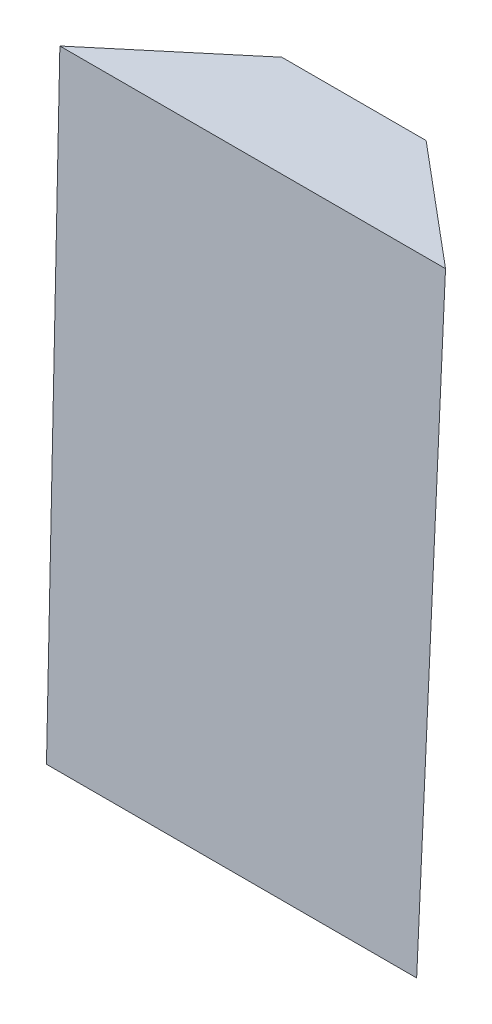
ISO-10303-21;
HEADER;
FILE_DESCRIPTION(('STEP AP214'),'2;1');
FILE_NAME('part.step','',(''),(''),'','','');
FILE_SCHEMA(('AUTOMOTIVE_DESIGN { 1 0 10303 214 1 1 1 1 }'));
ENDSEC;
DATA;
#1=APPLICATION_CONTEXT('core data for automotive mechanical design processes');
#2=APPLICATION_PROTOCOL_DEFINITION('international standard','automotive_design',2000,#1);
#3=PRODUCT_CONTEXT('',#1,'mechanical');
#4=PRODUCT('Part','Part','',(#3));
#5=PRODUCT_RELATED_PRODUCT_CATEGORY('part','',(#4));
#6=PRODUCT_DEFINITION_FORMATION('','',#4);
#7=PRODUCT_DEFINITION_CONTEXT('part definition',#1,'design');
#8=PRODUCT_DEFINITION('design','',#6,#7);
#9=PRODUCT_DEFINITION_SHAPE('','',#8);
#10=(LENGTH_UNIT() NAMED_UNIT(*) SI_UNIT(.MILLI.,.METRE.));
#11=(NAMED_UNIT(*) PLANE_ANGLE_UNIT() SI_UNIT($,.RADIAN.));
#12=(NAMED_UNIT(*) SI_UNIT($,.STERADIAN.) SOLID_ANGLE_UNIT());
#13=UNCERTAINTY_MEASURE_WITH_UNIT(LENGTH_MEASURE(1.E-05),#10,'distance_accuracy_value','');
#14=(GEOMETRIC_REPRESENTATION_CONTEXT(3) GLOBAL_UNCERTAINTY_ASSIGNED_CONTEXT((#13)) GLOBAL_UNIT_ASSIGNED_CONTEXT((#10,
#11,#12)) REPRESENTATION_CONTEXT('',''));
#15=CARTESIAN_POINT('',(0.,0.,0.));
#16=DIRECTION('',(0.,0.,1.));
#17=DIRECTION('',(1.,0.,0.));
#18=AXIS2_PLACEMENT_3D('',#15,#16,#17);
#19=CARTESIAN_POINT('',(0.,0.,0.));
#20=DIRECTION('',(0.,-1.,0.));
#21=DIRECTION('',(0.,0.,-1.));
#22=AXIS2_PLACEMENT_3D('',#19,#20,#21);
#23=PLANE('',#22);
#24=DIRECTION('',(-0.765867029985071,0.,0.642998983188813));
#25=VECTOR('',#24,1.);
#26=CARTESIAN_POINT('',(14.888573893751,0.,-12.5));
#27=LINE('',#26,#25);
#28=CARTESIAN_POINT('',(14.888573893751,0.,-12.5));
#29=VERTEX_POINT('',#28);
#30=CARTESIAN_POINT('',(0.,0.,0.));
#31=VERTEX_POINT('',#30);
#32=EDGE_CURVE('E209',#29,#31,#27,.T.);
#33=ORIENTED_EDGE('',*,*,#32,.F.);
#34=DIRECTION('',(-1.,0.,0.));
#35=VECTOR('',#34,1.);
#36=CARTESIAN_POINT('',(30.798573893751,0.,-12.5));
#37=LINE('',#36,#35);
#38=CARTESIAN_POINT('',(30.798573893751,0.,-12.5));
#39=VERTEX_POINT('',#38);
#40=EDGE_CURVE('E12',#39,#29,#37,.T.);
#41=ORIENTED_EDGE('',*,*,#40,.F.);
#42=DIRECTION('',(-0.76614015970432,0.,-0.6426735218509));
#43=VECTOR('',#42,1.);
#44=CARTESIAN_POINT('',(45.7,0.,0.));
#45=LINE('',#44,#43);
#46=CARTESIAN_POINT('',(45.7,0.,0.));
#47=VERTEX_POINT('',#46);
#48=EDGE_CURVE('E64',#47,#39,#45,.T.);
#49=ORIENTED_EDGE('',*,*,#48,.F.);
#50=DIRECTION('',(1.,0.,0.));
#51=VECTOR('',#50,1.);
#52=CARTESIAN_POINT('',(0.,0.,0.));
#53=LINE('',#52,#51);
#54=EDGE_CURVE('E207',#31,#47,#53,.T.);
#55=ORIENTED_EDGE('',*,*,#54,.F.);
#56=EDGE_LOOP('',(#33,#41,#49,#55));
#57=FACE_BOUND('',#56,.T.);
#58=ADVANCED_FACE('F53',(#57),#23,.T.);
#59=CARTESIAN_POINT('',(0.,75.,0.));
#60=DIRECTION('',(0.,-1.,0.));
#61=DIRECTION('',(0.,0.,-1.));
#62=AXIS2_PLACEMENT_3D('',#59,#60,#61);
#63=PLANE('',#62);
#64=DIRECTION('',(-0.766003646700725,0.,0.642836225831425));
#65=VECTOR('',#64,1.);
#66=CARTESIAN_POINT('',(-0.966426106249023,75.,-2.62));
#67=LINE('',#66,#65);
#68=CARTESIAN_POINT('',(13.928573893751,75.,-15.12));
#69=VERTEX_POINT('',#68);
#70=CARTESIAN_POINT('',(-0.966426106249023,75.,-2.62));
#71=VERTEX_POINT('',#70);
#72=EDGE_CURVE('E102',#69,#71,#67,.T.);
#73=ORIENTED_EDGE('',*,*,#72,.T.);
#74=DIRECTION('',(1.,0.,0.));
#75=VECTOR('',#74,1.);
#76=CARTESIAN_POINT('',(46.643573893751,75.,-2.62));
#77=LINE('',#76,#75);
#78=CARTESIAN_POINT('',(46.643573893751,75.,-2.62));
#79=VERTEX_POINT('',#78);
#80=EDGE_CURVE('E133',#71,#79,#77,.T.);
#81=ORIENTED_EDGE('',*,*,#80,.T.);
#82=DIRECTION('',(-0.766003646700725,0.,-0.642836225831425));
#83=VECTOR('',#82,1.);
#84=CARTESIAN_POINT('',(31.748573893751,75.,-15.12));
#85=LINE('',#84,#83);
#86=CARTESIAN_POINT('',(31.748573893751,75.,-15.12));
#87=VERTEX_POINT('',#86);
#88=EDGE_CURVE('E105',#79,#87,#85,.T.);
#89=ORIENTED_EDGE('',*,*,#88,.T.);
#90=DIRECTION('',(-1.,0.,0.));
#91=VECTOR('',#90,1.);
#92=CARTESIAN_POINT('',(13.928573893751,75.,-15.12));
#93=LINE('',#92,#91);
#94=EDGE_CURVE('E99',#87,#69,#93,.T.);
#95=ORIENTED_EDGE('',*,*,#94,.T.);
#96=EDGE_LOOP('',(#73,#81,#89,#95));
#97=FACE_BOUND('',#96,.T.);
#98=ADVANCED_FACE('F101',(#97),#63,.F.);
#99=CARTESIAN_POINT('',(-0.966426106249023,75.,-2.62));
#100=CARTESIAN_POINT('',(0.,0.,0.));
#101=CARTESIAN_POINT('',(1.51607389375098,75.,-4.70333333333333));
#102=CARTESIAN_POINT('',(2.48142898229183,0.,-2.08333333333333));
#103=CARTESIAN_POINT('',(3.99857389375098,75.,-6.78666666666667));
#104=CARTESIAN_POINT('',(4.96285796458366,0.,-4.16666666666666));
#105=CARTESIAN_POINT('',(8.96357389375098,75.,-10.9533333333333));
#106=CARTESIAN_POINT('',(9.92571592916732,0.,-8.33333333333333));
#107=CARTESIAN_POINT('',(11.446073893751,75.,-13.0366666666667));
#108=CARTESIAN_POINT('',(12.4071449114591,0.,-10.4166666666667));
#109=CARTESIAN_POINT('',(13.928573893751,75.,-15.12));
#110=CARTESIAN_POINT('',(14.888573893751,0.,-12.5));
#111=B_SPLINE_SURFACE_WITH_KNOTS('',3,1,((#99,#100),(#101,#102),(#103,#104),(#105,#106),(#107,
#108),(#109,#110)),.UNSPECIFIED.,.F.,.F.,.F.,(4,2,4),(2,2),(0.,0.5,1.),(0.,1.),.UNSPECIFIED.);
#112=DIRECTION('',(0.012791150448178,-0.999308628763905,0.0349091814314858));
#113=VECTOR('',#112,1.);
#114=CARTESIAN_POINT('',(14.408573893751,37.5,-13.81));
#115=LINE('',#114,#113);
#116=EDGE_CURVE('E72',#69,#29,#115,.T.);
#117=DIRECTION('',(-0.0128767584772663,0.999307530653691,-0.0349091430708356));
#118=VECTOR('',#117,1.);
#119=CARTESIAN_POINT('',(-0.483213053124512,37.5,-1.31));
#120=LINE('',#119,#118);
#121=EDGE_CURVE('E118',#31,#71,#120,.T.);
#122=ORIENTED_EDGE('',*,*,#72,.F.);
#123=ORIENTED_EDGE('',*,*,#116,.T.);
#124=ORIENTED_EDGE('',*,*,#32,.T.);
#125=ORIENTED_EDGE('',*,*,#121,.T.);
#126=EDGE_LOOP('',(#122,#123,#124,#125));
#127=FACE_BOUND('',#126,.T.);
#128=ADVANCED_FACE('F116',(#127),#111,.T.);
#129=CARTESIAN_POINT('',(0.,-0.436134435339033,-12.4847643703922));
#130=DIRECTION('',(0.,-0.0349120375891681,-0.999390389002902));
#131=DIRECTION('',(0.,0.999390389002902,-0.0349120375891681));
#132=AXIS2_PLACEMENT_3D('',#129,#130,#131);
#133=PLANE('',#132);
#134=DIRECTION('',(-0.0126579307583425,-0.999310323027041,0.0349092406177446));
#135=VECTOR('',#134,1.);
#136=CARTESIAN_POINT('',(31.748573893751,75.,-15.12));
#137=LINE('',#136,#135);
#138=EDGE_CURVE('E127',#87,#39,#137,.T.);
#139=ORIENTED_EDGE('',*,*,#138,.T.);
#140=ORIENTED_EDGE('',*,*,#40,.T.);
#141=ORIENTED_EDGE('',*,*,#116,.F.);
#142=ORIENTED_EDGE('',*,*,#94,.F.);
#143=EDGE_LOOP('',(#139,#140,#141,#142));
#144=FACE_BOUND('',#143,.T.);
#145=ADVANCED_FACE('F124',(#144),#133,.T.);
#146=CARTESIAN_POINT('',(0.,0.,0.));
#147=DIRECTION('',(0.,0.034912037589168,0.999390389002902));
#148=DIRECTION('',(0.,-0.999390389002902,0.034912037589168));
#149=AXIS2_PLACEMENT_3D('',#146,#147,#148);
#150=PLANE('',#149);
#151=ORIENTED_EDGE('',*,*,#121,.F.);
#152=ORIENTED_EDGE('',*,*,#54,.T.);
#153=DIRECTION('',(-0.0125723220140121,-0.999311402419705,0.0349092783245283));
#154=VECTOR('',#153,1.);
#155=CARTESIAN_POINT('',(46.1717869468755,37.5,-1.31));
#156=LINE('',#155,#154);
#157=EDGE_CURVE('E131',#79,#47,#156,.T.);
#158=ORIENTED_EDGE('',*,*,#157,.F.);
#159=ORIENTED_EDGE('',*,*,#80,.F.);
#160=EDGE_LOOP('',(#151,#152,#158,#159));
#161=FACE_BOUND('',#160,.T.);
#162=ADVANCED_FACE('F153',(#161),#150,.T.);
#163=CARTESIAN_POINT('',(31.748573893751,75.,-15.12));
#164=CARTESIAN_POINT('',(30.798573893751,0.,-12.5));
#165=CARTESIAN_POINT('',(34.231073893751,75.,-13.0366666666667));
#166=CARTESIAN_POINT('',(33.2821449114592,0.,-10.4166666666667));
#167=CARTESIAN_POINT('',(36.713573893751,75.,-10.9533333333334));
#168=CARTESIAN_POINT('',(35.7657159291673,0.,-8.33333333333332));
#169=CARTESIAN_POINT('',(41.678573893751,75.,-6.78666666666669));
#170=CARTESIAN_POINT('',(40.7328579645837,0.,-4.16666666666665));
#171=CARTESIAN_POINT('',(44.161073893751,75.,-4.70333333333335));
#172=CARTESIAN_POINT('',(43.2164289822918,0.,-2.08333333333333));
#173=CARTESIAN_POINT('',(46.643573893751,75.,-2.62));
#174=CARTESIAN_POINT('',(45.7,0.,0.));
#175=B_SPLINE_SURFACE_WITH_KNOTS('',3,1,((#163,#164),(#165,#166),(#167,#168),(#169,#170),(#171,
#172),(#173,#174)),.UNSPECIFIED.,.F.,.F.,.F.,(4,2,4),(2,2),(0.,0.5,1.),(0.,1.),.UNSPECIFIED.);
#176=ORIENTED_EDGE('',*,*,#88,.F.);
#177=ORIENTED_EDGE('',*,*,#157,.T.);
#178=ORIENTED_EDGE('',*,*,#48,.T.);
#179=ORIENTED_EDGE('',*,*,#138,.F.);
#180=EDGE_LOOP('',(#176,#177,#178,#179));
#181=FACE_BOUND('',#180,.T.);
#182=ADVANCED_FACE('F178',(#181),#175,.T.);
#183=CLOSED_SHELL('',(#58,#98,#128,#145,#162,#182));
#184=MANIFOLD_SOLID_BREP('B2',#183);
#185=ADVANCED_BREP_SHAPE_REPRESENTATION('',(#18,#184),#14);
#186=SHAPE_DEFINITION_REPRESENTATION(#9,#185);
ENDSEC;
END-ISO-10303-21;
